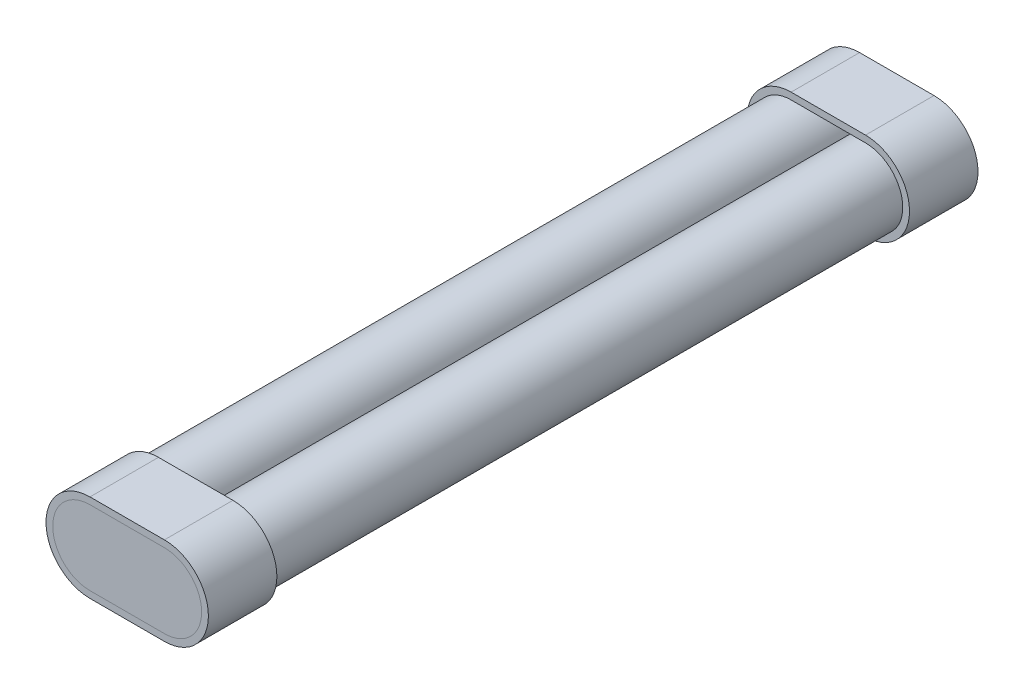
ISO-10303-21;
HEADER;
FILE_DESCRIPTION(('STEP AP214'),'2;1');
FILE_NAME('part.step','',(''),(''),'','','');
FILE_SCHEMA(('AUTOMOTIVE_DESIGN { 1 0 10303 214 1 1 1 1 }'));
ENDSEC;
DATA;
#1=APPLICATION_CONTEXT('core data for automotive mechanical design processes');
#2=APPLICATION_PROTOCOL_DEFINITION('international standard','automotive_design',2000,#1);
#3=PRODUCT_CONTEXT('',#1,'mechanical');
#4=PRODUCT('Part','Part','',(#3));
#5=PRODUCT_RELATED_PRODUCT_CATEGORY('part','',(#4));
#6=PRODUCT_DEFINITION_FORMATION('','',#4);
#7=PRODUCT_DEFINITION_CONTEXT('part definition',#1,'design');
#8=PRODUCT_DEFINITION('design','',#6,#7);
#9=PRODUCT_DEFINITION_SHAPE('','',#8);
#10=(LENGTH_UNIT() NAMED_UNIT(*) SI_UNIT(.MILLI.,.METRE.));
#11=(NAMED_UNIT(*) PLANE_ANGLE_UNIT() SI_UNIT($,.RADIAN.));
#12=(NAMED_UNIT(*) SI_UNIT($,.STERADIAN.) SOLID_ANGLE_UNIT());
#13=UNCERTAINTY_MEASURE_WITH_UNIT(LENGTH_MEASURE(1.E-05),#10,'distance_accuracy_value','');
#14=(GEOMETRIC_REPRESENTATION_CONTEXT(3) GLOBAL_UNCERTAINTY_ASSIGNED_CONTEXT((#13)) GLOBAL_UNIT_ASSIGNED_CONTEXT((#10,
#11,#12)) REPRESENTATION_CONTEXT('',''));
#15=CARTESIAN_POINT('',(0.,0.,0.));
#16=DIRECTION('',(0.,0.,1.));
#17=DIRECTION('',(1.,0.,0.));
#18=AXIS2_PLACEMENT_3D('',#15,#16,#17);
#19=CARTESIAN_POINT('',(0.,-11.,-225.5));
#20=DIRECTION('',(0.,1.,0.));
#21=DIRECTION('',(-1.,0.,0.));
#22=AXIS2_PLACEMENT_3D('',#19,#20,#21);
#23=PLANE('',#22);
#24=DIRECTION('',(-1.,0.,0.));
#25=VECTOR('',#24,1.);
#26=CARTESIAN_POINT('',(0.,-11.,-223.5));
#27=LINE('',#26,#25);
#28=CARTESIAN_POINT('',(11.,-11.,-223.5));
#29=VERTEX_POINT('',#28);
#30=CARTESIAN_POINT('',(-11.,-11.,-223.5));
#31=VERTEX_POINT('',#30);
#32=EDGE_CURVE('E118',#29,#31,#27,.T.);
#33=ORIENTED_EDGE('',*,*,#32,.T.);
#34=DIRECTION('',(0.,0.,1.));
#35=VECTOR('',#34,1.);
#36=CARTESIAN_POINT('',(-11.,-11.,-225.5));
#37=LINE('',#36,#35);
#38=CARTESIAN_POINT('',(-11.,-11.,-225.5));
#39=VERTEX_POINT('',#38);
#40=EDGE_CURVE('E13',#39,#31,#37,.T.);
#41=ORIENTED_EDGE('',*,*,#40,.F.);
#42=DIRECTION('',(-1.,0.,0.));
#43=VECTOR('',#42,1.);
#44=CARTESIAN_POINT('',(0.,-11.,-225.5));
#45=LINE('',#44,#43);
#46=CARTESIAN_POINT('',(11.,-11.,-225.5));
#47=VERTEX_POINT('',#46);
#48=EDGE_CURVE('E103',#47,#39,#45,.T.);
#49=ORIENTED_EDGE('',*,*,#48,.F.);
#50=DIRECTION('',(0.,0.,1.));
#51=VECTOR('',#50,1.);
#52=CARTESIAN_POINT('',(11.,-11.,-225.5));
#53=LINE('',#52,#51);
#54=EDGE_CURVE('E114',#47,#29,#53,.T.);
#55=ORIENTED_EDGE('',*,*,#54,.T.);
#56=EDGE_LOOP('',(#33,#41,#49,#55));
#57=FACE_BOUND('',#56,.T.);
#58=ADVANCED_FACE('F56',(#57),#23,.F.);
#59=CARTESIAN_POINT('',(-11.,0.,-225.5));
#60=DIRECTION('',(0.,0.,1.));
#61=DIRECTION('',(1.,0.,0.));
#62=AXIS2_PLACEMENT_3D('',#59,#60,#61);
#63=CYLINDRICAL_SURFACE('',#62,11.);
#64=CARTESIAN_POINT('',(-11.,0.,-223.5));
#65=DIRECTION('',(0.,0.,-1.));
#66=DIRECTION('',(-1.,0.,0.));
#67=AXIS2_PLACEMENT_3D('',#64,#65,#66);
#68=CIRCLE('',#67,11.);
#69=CARTESIAN_POINT('',(-11.,11.,-223.5));
#70=VERTEX_POINT('',#69);
#71=EDGE_CURVE('E108',#31,#70,#68,.T.);
#72=ORIENTED_EDGE('',*,*,#71,.T.);
#73=DIRECTION('',(0.,0.,1.));
#74=VECTOR('',#73,1.);
#75=CARTESIAN_POINT('',(-11.,11.,-225.5));
#76=LINE('',#75,#74);
#77=CARTESIAN_POINT('',(-11.,11.,-225.5));
#78=VERTEX_POINT('',#77);
#79=EDGE_CURVE('E64',#78,#70,#76,.T.);
#80=ORIENTED_EDGE('',*,*,#79,.F.);
#81=CARTESIAN_POINT('',(-11.,0.,-225.5));
#82=DIRECTION('',(0.,0.,-1.));
#83=DIRECTION('',(-1.,0.,0.));
#84=AXIS2_PLACEMENT_3D('',#81,#82,#83);
#85=CIRCLE('',#84,11.);
#86=EDGE_CURVE('E98',#39,#78,#85,.T.);
#87=ORIENTED_EDGE('',*,*,#86,.F.);
#88=ORIENTED_EDGE('',*,*,#40,.T.);
#89=EDGE_LOOP('',(#72,#80,#87,#88));
#90=FACE_BOUND('',#89,.T.);
#91=ADVANCED_FACE('F107',(#90),#63,.T.);
#92=CARTESIAN_POINT('',(0.,11.,-225.5));
#93=DIRECTION('',(0.,1.,0.));
#94=DIRECTION('',(-1.,0.,0.));
#95=AXIS2_PLACEMENT_3D('',#92,#93,#94);
#96=PLANE('',#95);
#97=DIRECTION('',(-1.,0.,0.));
#98=VECTOR('',#97,1.);
#99=CARTESIAN_POINT('',(0.,11.,-223.5));
#100=LINE('',#99,#98);
#101=CARTESIAN_POINT('',(11.,11.,-223.5));
#102=VERTEX_POINT('',#101);
#103=EDGE_CURVE('E122',#102,#70,#100,.T.);
#104=ORIENTED_EDGE('',*,*,#103,.F.);
#105=DIRECTION('',(0.,0.,1.));
#106=VECTOR('',#105,1.);
#107=CARTESIAN_POINT('',(11.,11.,-225.5));
#108=LINE('',#107,#106);
#109=CARTESIAN_POINT('',(11.,11.,-225.5));
#110=VERTEX_POINT('',#109);
#111=EDGE_CURVE('E88',#110,#102,#108,.T.);
#112=ORIENTED_EDGE('',*,*,#111,.F.);
#113=DIRECTION('',(-1.,0.,0.));
#114=VECTOR('',#113,1.);
#115=CARTESIAN_POINT('',(0.,11.,-225.5));
#116=LINE('',#115,#114);
#117=EDGE_CURVE('E101',#110,#78,#116,.T.);
#118=ORIENTED_EDGE('',*,*,#117,.T.);
#119=ORIENTED_EDGE('',*,*,#79,.T.);
#120=EDGE_LOOP('',(#104,#112,#118,#119));
#121=FACE_BOUND('',#120,.T.);
#122=ADVANCED_FACE('F112',(#121),#96,.T.);
#123=CARTESIAN_POINT('',(11.,0.,-225.5));
#124=DIRECTION('',(0.,0.,1.));
#125=DIRECTION('',(1.,0.,0.));
#126=AXIS2_PLACEMENT_3D('',#123,#124,#125);
#127=CYLINDRICAL_SURFACE('',#126,11.);
#128=CARTESIAN_POINT('',(11.,0.,-223.5));
#129=DIRECTION('',(0.,0.,-1.));
#130=DIRECTION('',(-1.,0.,0.));
#131=AXIS2_PLACEMENT_3D('',#128,#129,#130);
#132=CIRCLE('',#131,11.);
#133=EDGE_CURVE('E91',#102,#29,#132,.T.);
#134=ORIENTED_EDGE('',*,*,#133,.T.);
#135=ORIENTED_EDGE('',*,*,#54,.F.);
#136=CARTESIAN_POINT('',(11.,0.,-225.5));
#137=DIRECTION('',(0.,0.,-1.));
#138=DIRECTION('',(-1.,0.,0.));
#139=AXIS2_PLACEMENT_3D('',#136,#137,#138);
#140=CIRCLE('',#139,11.);
#141=EDGE_CURVE('E72',#110,#47,#140,.T.);
#142=ORIENTED_EDGE('',*,*,#141,.F.);
#143=ORIENTED_EDGE('',*,*,#111,.T.);
#144=EDGE_LOOP('',(#134,#135,#142,#143));
#145=FACE_BOUND('',#144,.T.);
#146=ADVANCED_FACE('F135',(#145),#127,.T.);
#147=CARTESIAN_POINT('',(0.,0.,-225.5));
#148=DIRECTION('',(0.,0.,-1.));
#149=DIRECTION('',(-1.,0.,0.));
#150=AXIS2_PLACEMENT_3D('',#147,#148,#149);
#151=PLANE('',#150);
#152=ORIENTED_EDGE('',*,*,#48,.T.);
#153=ORIENTED_EDGE('',*,*,#86,.T.);
#154=ORIENTED_EDGE('',*,*,#117,.F.);
#155=ORIENTED_EDGE('',*,*,#141,.T.);
#156=EDGE_LOOP('',(#152,#153,#154,#155));
#157=FACE_BOUND('',#156,.T.);
#158=ADVANCED_FACE('F99',(#157),#151,.T.);
#159=CARTESIAN_POINT('',(0.,0.,-223.5));
#160=DIRECTION('',(0.,0.,-1.));
#161=DIRECTION('',(-1.,0.,0.));
#162=AXIS2_PLACEMENT_3D('',#159,#160,#161);
#163=PLANE('',#162);
#164=ORIENTED_EDGE('',*,*,#32,.F.);
#165=ORIENTED_EDGE('',*,*,#133,.F.);
#166=ORIENTED_EDGE('',*,*,#103,.T.);
#167=ORIENTED_EDGE('',*,*,#71,.F.);
#168=EDGE_LOOP('',(#164,#165,#166,#167));
#169=FACE_BOUND('',#168,.T.);
#170=ADVANCED_FACE('F129',(#169),#163,.F.);
#171=CLOSED_SHELL('',(#58,#91,#122,#146,#158,#170));
#172=MANIFOLD_SOLID_BREP('B2',#171);
#173=CARTESIAN_POINT('',(0.,-13.,-225.5));
#174=DIRECTION('',(0.,1.,0.));
#175=DIRECTION('',(0.,0.,1.));
#176=AXIS2_PLACEMENT_3D('',#173,#174,#175);
#177=PLANE('',#176);
#178=DIRECTION('',(0.,0.,1.));
#179=VECTOR('',#178,1.);
#180=CARTESIAN_POINT('',(11.,-13.,-225.5));
#181=LINE('',#180,#179);
#182=CARTESIAN_POINT('',(11.,-13.,-225.5));
#183=VERTEX_POINT('',#182);
#184=CARTESIAN_POINT('',(11.,-13.,-205.25));
#185=VERTEX_POINT('',#184);
#186=EDGE_CURVE('E300',#183,#185,#181,.T.);
#187=ORIENTED_EDGE('',*,*,#186,.T.);
#188=DIRECTION('',(-1.,0.,0.));
#189=VECTOR('',#188,1.);
#190=CARTESIAN_POINT('',(0.,-13.,-205.25));
#191=LINE('',#190,#189);
#192=CARTESIAN_POINT('',(-11.,-13.,-205.25));
#193=VERTEX_POINT('',#192);
#194=EDGE_CURVE('E319',#185,#193,#191,.T.);
#195=ORIENTED_EDGE('',*,*,#194,.T.);
#196=DIRECTION('',(0.,0.,1.));
#197=VECTOR('',#196,1.);
#198=CARTESIAN_POINT('',(-11.,-13.,-225.5));
#199=LINE('',#198,#197);
#200=CARTESIAN_POINT('',(-11.,-13.,-225.5));
#201=VERTEX_POINT('',#200);
#202=EDGE_CURVE('E54',#201,#193,#199,.T.);
#203=ORIENTED_EDGE('',*,*,#202,.F.);
#204=DIRECTION('',(-1.,0.,0.));
#205=VECTOR('',#204,1.);
#206=CARTESIAN_POINT('',(0.,-13.,-225.5));
#207=LINE('',#206,#205);
#208=EDGE_CURVE('E340',#183,#201,#207,.T.);
#209=ORIENTED_EDGE('',*,*,#208,.F.);
#210=EDGE_LOOP('',(#187,#195,#203,#209));
#211=FACE_BOUND('',#210,.T.);
#212=ADVANCED_FACE('F223',(#211),#177,.F.);
#213=CARTESIAN_POINT('',(-11.,0.,-225.5));
#214=DIRECTION('',(0.,0.,1.));
#215=DIRECTION('',(1.,0.,0.));
#216=AXIS2_PLACEMENT_3D('',#213,#214,#215);
#217=CYLINDRICAL_SURFACE('',#216,13.);
#218=ORIENTED_EDGE('',*,*,#202,.T.);
#219=CARTESIAN_POINT('',(-11.,0.,-205.25));
#220=DIRECTION('',(0.,0.,-1.));
#221=DIRECTION('',(-1.,0.,0.));
#222=AXIS2_PLACEMENT_3D('',#219,#220,#221);
#223=CIRCLE('',#222,13.);
#224=CARTESIAN_POINT('',(-11.,13.,-205.25));
#225=VERTEX_POINT('',#224);
#226=EDGE_CURVE('E322',#193,#225,#223,.T.);
#227=ORIENTED_EDGE('',*,*,#226,.T.);
#228=DIRECTION('',(0.,0.,1.));
#229=VECTOR('',#228,1.);
#230=CARTESIAN_POINT('',(-11.,13.,-225.5));
#231=LINE('',#230,#229);
#232=CARTESIAN_POINT('',(-11.,13.,-225.5));
#233=VERTEX_POINT('',#232);
#234=EDGE_CURVE('E232',#233,#225,#231,.T.);
#235=ORIENTED_EDGE('',*,*,#234,.F.);
#236=CARTESIAN_POINT('',(-11.,0.,-225.5));
#237=DIRECTION('',(0.,0.,-1.));
#238=DIRECTION('',(-1.,0.,0.));
#239=AXIS2_PLACEMENT_3D('',#236,#237,#238);
#240=CIRCLE('',#239,13.);
#241=EDGE_CURVE('E342',#201,#233,#240,.T.);
#242=ORIENTED_EDGE('',*,*,#241,.F.);
#243=EDGE_LOOP('',(#218,#227,#235,#242));
#244=FACE_BOUND('',#243,.T.);
#245=ADVANCED_FACE('F372',(#244),#217,.T.);
#246=CARTESIAN_POINT('',(0.,13.,-225.5));
#247=DIRECTION('',(0.,1.,0.));
#248=DIRECTION('',(0.,0.,1.));
#249=AXIS2_PLACEMENT_3D('',#246,#247,#248);
#250=PLANE('',#249);
#251=ORIENTED_EDGE('',*,*,#234,.T.);
#252=DIRECTION('',(-1.,0.,0.));
#253=VECTOR('',#252,1.);
#254=CARTESIAN_POINT('',(0.,13.,-205.25));
#255=LINE('',#254,#253);
#256=CARTESIAN_POINT('',(11.,13.,-205.25));
#257=VERTEX_POINT('',#256);
#258=EDGE_CURVE('E325',#257,#225,#255,.T.);
#259=ORIENTED_EDGE('',*,*,#258,.F.);
#260=DIRECTION('',(0.,0.,1.));
#261=VECTOR('',#260,1.);
#262=CARTESIAN_POINT('',(11.,13.,-225.5));
#263=LINE('',#262,#261);
#264=CARTESIAN_POINT('',(11.,13.,-225.5));
#265=VERTEX_POINT('',#264);
#266=EDGE_CURVE('E248',#265,#257,#263,.T.);
#267=ORIENTED_EDGE('',*,*,#266,.F.);
#268=DIRECTION('',(-1.,0.,0.));
#269=VECTOR('',#268,1.);
#270=CARTESIAN_POINT('',(0.,13.,-225.5));
#271=LINE('',#270,#269);
#272=EDGE_CURVE('E344',#265,#233,#271,.T.);
#273=ORIENTED_EDGE('',*,*,#272,.T.);
#274=EDGE_LOOP('',(#251,#259,#267,#273));
#275=FACE_BOUND('',#274,.T.);
#276=ADVANCED_FACE('F377',(#275),#250,.T.);
#277=CARTESIAN_POINT('',(11.,0.,-225.5));
#278=DIRECTION('',(0.,0.,1.));
#279=DIRECTION('',(1.,0.,0.));
#280=AXIS2_PLACEMENT_3D('',#277,#278,#279);
#281=CYLINDRICAL_SURFACE('',#280,11.);
#282=DIRECTION('',(0.,0.,1.));
#283=VECTOR('',#282,1.);
#284=CARTESIAN_POINT('',(11.,-11.,-225.5));
#285=LINE('',#284,#283);
#286=CARTESIAN_POINT('',(11.,-11.,-225.5));
#287=VERTEX_POINT('',#286);
#288=CARTESIAN_POINT('',(11.,-11.,-205.25));
#289=VERTEX_POINT('',#288);
#290=EDGE_CURVE('E304',#287,#289,#285,.T.);
#291=ORIENTED_EDGE('',*,*,#290,.T.);
#292=CARTESIAN_POINT('',(11.,0.,-205.25));
#293=DIRECTION('',(0.,0.,-1.));
#294=DIRECTION('',(-1.,0.,0.));
#295=AXIS2_PLACEMENT_3D('',#292,#293,#294);
#296=CIRCLE('',#295,11.);
#297=CARTESIAN_POINT('',(11.,11.,-205.25));
#298=VERTEX_POINT('',#297);
#299=EDGE_CURVE('E303',#298,#289,#296,.T.);
#300=ORIENTED_EDGE('',*,*,#299,.F.);
#301=DIRECTION('',(0.,0.,1.));
#302=VECTOR('',#301,1.);
#303=CARTESIAN_POINT('',(11.,11.,-225.5));
#304=LINE('',#303,#302);
#305=CARTESIAN_POINT('',(11.,11.,-225.5));
#306=VERTEX_POINT('',#305);
#307=EDGE_CURVE('E227',#306,#298,#304,.T.);
#308=ORIENTED_EDGE('',*,*,#307,.F.);
#309=CARTESIAN_POINT('',(11.,0.,-225.5));
#310=DIRECTION('',(0.,0.,-1.));
#311=DIRECTION('',(-1.,0.,0.));
#312=AXIS2_PLACEMENT_3D('',#309,#310,#311);
#313=CIRCLE('',#312,11.);
#314=EDGE_CURVE('E331',#306,#287,#313,.T.);
#315=ORIENTED_EDGE('',*,*,#314,.T.);
#316=EDGE_LOOP('',(#291,#300,#308,#315));
#317=FACE_BOUND('',#316,.T.);
#318=ADVANCED_FACE('F225',(#317),#281,.F.);
#319=CARTESIAN_POINT('',(0.,11.,-225.5));
#320=DIRECTION('',(0.,1.,0.));
#321=DIRECTION('',(-1.,0.,0.));
#322=AXIS2_PLACEMENT_3D('',#319,#320,#321);
#323=PLANE('',#322);
#324=ORIENTED_EDGE('',*,*,#307,.T.);
#325=DIRECTION('',(-1.,0.,0.));
#326=VECTOR('',#325,1.);
#327=CARTESIAN_POINT('',(0.,11.,-205.25));
#328=LINE('',#327,#326);
#329=CARTESIAN_POINT('',(-11.,11.,-205.25));
#330=VERTEX_POINT('',#329);
#331=EDGE_CURVE('E295',#298,#330,#328,.T.);
#332=ORIENTED_EDGE('',*,*,#331,.T.);
#333=DIRECTION('',(0.,0.,1.));
#334=VECTOR('',#333,1.);
#335=CARTESIAN_POINT('',(-11.,11.,-225.5));
#336=LINE('',#335,#334);
#337=CARTESIAN_POINT('',(-11.,11.,-225.5));
#338=VERTEX_POINT('',#337);
#339=EDGE_CURVE('E301',#338,#330,#336,.T.);
#340=ORIENTED_EDGE('',*,*,#339,.F.);
#341=DIRECTION('',(-1.,0.,0.));
#342=VECTOR('',#341,1.);
#343=CARTESIAN_POINT('',(0.,11.,-225.5));
#344=LINE('',#343,#342);
#345=EDGE_CURVE('E296',#306,#338,#344,.T.);
#346=ORIENTED_EDGE('',*,*,#345,.F.);
#347=EDGE_LOOP('',(#324,#332,#340,#346));
#348=FACE_BOUND('',#347,.T.);
#349=ADVANCED_FACE('F292',(#348),#323,.F.);
#350=CARTESIAN_POINT('',(-11.,0.,-225.5));
#351=DIRECTION('',(0.,0.,1.));
#352=DIRECTION('',(1.,0.,0.));
#353=AXIS2_PLACEMENT_3D('',#350,#351,#352);
#354=CYLINDRICAL_SURFACE('',#353,11.);
#355=ORIENTED_EDGE('',*,*,#339,.T.);
#356=CARTESIAN_POINT('',(-11.,0.,-205.25));
#357=DIRECTION('',(0.,0.,-1.));
#358=DIRECTION('',(-1.,0.,0.));
#359=AXIS2_PLACEMENT_3D('',#356,#357,#358);
#360=CIRCLE('',#359,11.);
#361=CARTESIAN_POINT('',(-11.,-11.,-205.25));
#362=VERTEX_POINT('',#361);
#363=EDGE_CURVE('E313',#362,#330,#360,.T.);
#364=ORIENTED_EDGE('',*,*,#363,.F.);
#365=DIRECTION('',(0.,0.,1.));
#366=VECTOR('',#365,1.);
#367=CARTESIAN_POINT('',(-11.,-11.,-225.5));
#368=LINE('',#367,#366);
#369=CARTESIAN_POINT('',(-11.,-11.,-225.5));
#370=VERTEX_POINT('',#369);
#371=EDGE_CURVE('E351',#370,#362,#368,.T.);
#372=ORIENTED_EDGE('',*,*,#371,.F.);
#373=CARTESIAN_POINT('',(-11.,0.,-225.5));
#374=DIRECTION('',(0.,0.,-1.));
#375=DIRECTION('',(-1.,0.,0.));
#376=AXIS2_PLACEMENT_3D('',#373,#374,#375);
#377=CIRCLE('',#376,11.);
#378=EDGE_CURVE('E334',#370,#338,#377,.T.);
#379=ORIENTED_EDGE('',*,*,#378,.T.);
#380=EDGE_LOOP('',(#355,#364,#372,#379));
#381=FACE_BOUND('',#380,.T.);
#382=ADVANCED_FACE('F353',(#381),#354,.F.);
#383=CARTESIAN_POINT('',(0.,-11.,-225.5));
#384=DIRECTION('',(0.,1.,0.));
#385=DIRECTION('',(-1.,0.,0.));
#386=AXIS2_PLACEMENT_3D('',#383,#384,#385);
#387=PLANE('',#386);
#388=ORIENTED_EDGE('',*,*,#371,.T.);
#389=DIRECTION('',(-1.,0.,0.));
#390=VECTOR('',#389,1.);
#391=CARTESIAN_POINT('',(0.,-11.,-205.25));
#392=LINE('',#391,#390);
#393=EDGE_CURVE('E315',#289,#362,#392,.T.);
#394=ORIENTED_EDGE('',*,*,#393,.F.);
#395=ORIENTED_EDGE('',*,*,#290,.F.);
#396=DIRECTION('',(-1.,0.,0.));
#397=VECTOR('',#396,1.);
#398=CARTESIAN_POINT('',(0.,-11.,-225.5));
#399=LINE('',#398,#397);
#400=EDGE_CURVE('E337',#287,#370,#399,.T.);
#401=ORIENTED_EDGE('',*,*,#400,.T.);
#402=EDGE_LOOP('',(#388,#394,#395,#401));
#403=FACE_BOUND('',#402,.T.);
#404=ADVANCED_FACE('F359',(#403),#387,.T.);
#405=CARTESIAN_POINT('',(11.,0.,-225.5));
#406=DIRECTION('',(0.,0.,1.));
#407=DIRECTION('',(1.,0.,0.));
#408=AXIS2_PLACEMENT_3D('',#405,#406,#407);
#409=CYLINDRICAL_SURFACE('',#408,13.);
#410=ORIENTED_EDGE('',*,*,#266,.T.);
#411=CARTESIAN_POINT('',(11.,0.,-205.25));
#412=DIRECTION('',(0.,0.,-1.));
#413=DIRECTION('',(-1.,0.,0.));
#414=AXIS2_PLACEMENT_3D('',#411,#412,#413);
#415=CIRCLE('',#414,13.);
#416=EDGE_CURVE('E328',#257,#185,#415,.T.);
#417=ORIENTED_EDGE('',*,*,#416,.T.);
#418=ORIENTED_EDGE('',*,*,#186,.F.);
#419=CARTESIAN_POINT('',(11.,0.,-225.5));
#420=DIRECTION('',(0.,0.,-1.));
#421=DIRECTION('',(-1.,0.,0.));
#422=AXIS2_PLACEMENT_3D('',#419,#420,#421);
#423=CIRCLE('',#422,13.);
#424=EDGE_CURVE('E240',#265,#183,#423,.T.);
#425=ORIENTED_EDGE('',*,*,#424,.F.);
#426=EDGE_LOOP('',(#410,#417,#418,#425));
#427=FACE_BOUND('',#426,.T.);
#428=ADVANCED_FACE('F361',(#427),#409,.T.);
#429=CARTESIAN_POINT('',(0.,0.,-225.5));
#430=DIRECTION('',(0.,0.,-1.));
#431=DIRECTION('',(-1.,0.,0.));
#432=AXIS2_PLACEMENT_3D('',#429,#430,#431);
#433=PLANE('',#432);
#434=ORIENTED_EDGE('',*,*,#314,.F.);
#435=ORIENTED_EDGE('',*,*,#345,.T.);
#436=ORIENTED_EDGE('',*,*,#378,.F.);
#437=ORIENTED_EDGE('',*,*,#400,.F.);
#438=EDGE_LOOP('',(#434,#435,#436,#437));
#439=FACE_BOUND('',#438,.T.);
#440=ORIENTED_EDGE('',*,*,#208,.T.);
#441=ORIENTED_EDGE('',*,*,#241,.T.);
#442=ORIENTED_EDGE('',*,*,#272,.F.);
#443=ORIENTED_EDGE('',*,*,#424,.T.);
#444=EDGE_LOOP('',(#440,#441,#442,#443));
#445=FACE_BOUND('',#444,.T.);
#446=ADVANCED_FACE('F357',(#439,#445),#433,.T.);
#447=CARTESIAN_POINT('',(0.,0.,-205.25));
#448=DIRECTION('',(0.,0.,-1.));
#449=DIRECTION('',(-1.,0.,0.));
#450=AXIS2_PLACEMENT_3D('',#447,#448,#449);
#451=PLANE('',#450);
#452=ORIENTED_EDGE('',*,*,#299,.T.);
#453=ORIENTED_EDGE('',*,*,#393,.T.);
#454=ORIENTED_EDGE('',*,*,#363,.T.);
#455=ORIENTED_EDGE('',*,*,#331,.F.);
#456=EDGE_LOOP('',(#452,#453,#454,#455));
#457=FACE_BOUND('',#456,.T.);
#458=ORIENTED_EDGE('',*,*,#194,.F.);
#459=ORIENTED_EDGE('',*,*,#416,.F.);
#460=ORIENTED_EDGE('',*,*,#258,.T.);
#461=ORIENTED_EDGE('',*,*,#226,.F.);
#462=EDGE_LOOP('',(#458,#459,#460,#461));
#463=FACE_BOUND('',#462,.T.);
#464=ADVANCED_FACE('F310',(#457,#463),#451,.F.);
#465=CLOSED_SHELL('',(#212,#245,#276,#318,#349,#382,#404,#428,#446,#464));
#466=MANIFOLD_SOLID_BREP('B7',#465);
#467=CARTESIAN_POINT('',(0.,-11.,2.));
#468=DIRECTION('',(0.,1.,0.));
#469=DIRECTION('',(0.,0.,1.));
#470=AXIS2_PLACEMENT_3D('',#467,#468,#469);
#471=PLANE('',#470);
#472=DIRECTION('',(1.,0.,0.));
#473=VECTOR('',#472,1.);
#474=CARTESIAN_POINT('',(0.,-11.,0.));
#475=LINE('',#474,#473);
#476=CARTESIAN_POINT('',(-11.,-11.,0.));
#477=VERTEX_POINT('',#476);
#478=CARTESIAN_POINT('',(11.,-11.,0.));
#479=VERTEX_POINT('',#478);
#480=EDGE_CURVE('E548',#477,#479,#475,.T.);
#481=ORIENTED_EDGE('',*,*,#480,.T.);
#482=DIRECTION('',(0.,0.,-1.));
#483=VECTOR('',#482,1.);
#484=CARTESIAN_POINT('',(11.,-11.,2.));
#485=LINE('',#484,#483);
#486=CARTESIAN_POINT('',(11.,-11.,2.));
#487=VERTEX_POINT('',#486);
#488=EDGE_CURVE('E221',#487,#479,#485,.T.);
#489=ORIENTED_EDGE('',*,*,#488,.F.);
#490=DIRECTION('',(1.,0.,0.));
#491=VECTOR('',#490,1.);
#492=CARTESIAN_POINT('',(0.,-11.,2.));
#493=LINE('',#492,#491);
#494=CARTESIAN_POINT('',(-11.,-11.,2.));
#495=VERTEX_POINT('',#494);
#496=EDGE_CURVE('E533',#495,#487,#493,.T.);
#497=ORIENTED_EDGE('',*,*,#496,.F.);
#498=DIRECTION('',(0.,0.,-1.));
#499=VECTOR('',#498,1.);
#500=CARTESIAN_POINT('',(-11.,-11.,2.));
#501=LINE('',#500,#499);
#502=EDGE_CURVE('E544',#495,#477,#501,.T.);
#503=ORIENTED_EDGE('',*,*,#502,.T.);
#504=EDGE_LOOP('',(#481,#489,#497,#503));
#505=FACE_BOUND('',#504,.T.);
#506=ADVANCED_FACE('F486',(#505),#471,.F.);
#507=CARTESIAN_POINT('',(11.,0.,2.));
#508=DIRECTION('',(0.,0.,-1.));
#509=DIRECTION('',(-1.,0.,0.));
#510=AXIS2_PLACEMENT_3D('',#507,#508,#509);
#511=CYLINDRICAL_SURFACE('',#510,11.);
#512=CARTESIAN_POINT('',(11.,0.,0.));
#513=DIRECTION('',(0.,0.,1.));
#514=DIRECTION('',(1.,0.,0.));
#515=AXIS2_PLACEMENT_3D('',#512,#513,#514);
#516=CIRCLE('',#515,11.);
#517=CARTESIAN_POINT('',(11.,11.,0.));
#518=VERTEX_POINT('',#517);
#519=EDGE_CURVE('E538',#479,#518,#516,.T.);
#520=ORIENTED_EDGE('',*,*,#519,.T.);
#521=DIRECTION('',(0.,0.,-1.));
#522=VECTOR('',#521,1.);
#523=CARTESIAN_POINT('',(11.,11.,2.));
#524=LINE('',#523,#522);
#525=CARTESIAN_POINT('',(11.,11.,2.));
#526=VERTEX_POINT('',#525);
#527=EDGE_CURVE('E494',#526,#518,#524,.T.);
#528=ORIENTED_EDGE('',*,*,#527,.F.);
#529=CARTESIAN_POINT('',(11.,0.,2.));
#530=DIRECTION('',(0.,0.,1.));
#531=DIRECTION('',(1.,0.,0.));
#532=AXIS2_PLACEMENT_3D('',#529,#530,#531);
#533=CIRCLE('',#532,11.);
#534=EDGE_CURVE('E528',#487,#526,#533,.T.);
#535=ORIENTED_EDGE('',*,*,#534,.F.);
#536=ORIENTED_EDGE('',*,*,#488,.T.);
#537=EDGE_LOOP('',(#520,#528,#535,#536));
#538=FACE_BOUND('',#537,.T.);
#539=ADVANCED_FACE('F537',(#538),#511,.T.);
#540=CARTESIAN_POINT('',(0.,11.,2.));
#541=DIRECTION('',(0.,1.,0.));
#542=DIRECTION('',(0.,0.,1.));
#543=AXIS2_PLACEMENT_3D('',#540,#541,#542);
#544=PLANE('',#543);
#545=DIRECTION('',(1.,0.,0.));
#546=VECTOR('',#545,1.);
#547=CARTESIAN_POINT('',(0.,11.,0.));
#548=LINE('',#547,#546);
#549=CARTESIAN_POINT('',(-11.,11.,0.));
#550=VERTEX_POINT('',#549);
#551=EDGE_CURVE('E552',#550,#518,#548,.T.);
#552=ORIENTED_EDGE('',*,*,#551,.F.);
#553=DIRECTION('',(0.,0.,-1.));
#554=VECTOR('',#553,1.);
#555=CARTESIAN_POINT('',(-11.,11.,2.));
#556=LINE('',#555,#554);
#557=CARTESIAN_POINT('',(-11.,11.,2.));
#558=VERTEX_POINT('',#557);
#559=EDGE_CURVE('E518',#558,#550,#556,.T.);
#560=ORIENTED_EDGE('',*,*,#559,.F.);
#561=DIRECTION('',(1.,0.,0.));
#562=VECTOR('',#561,1.);
#563=CARTESIAN_POINT('',(0.,11.,2.));
#564=LINE('',#563,#562);
#565=EDGE_CURVE('E531',#558,#526,#564,.T.);
#566=ORIENTED_EDGE('',*,*,#565,.T.);
#567=ORIENTED_EDGE('',*,*,#527,.T.);
#568=EDGE_LOOP('',(#552,#560,#566,#567));
#569=FACE_BOUND('',#568,.T.);
#570=ADVANCED_FACE('F542',(#569),#544,.T.);
#571=CARTESIAN_POINT('',(-11.,0.,2.));
#572=DIRECTION('',(0.,0.,-1.));
#573=DIRECTION('',(-1.,0.,0.));
#574=AXIS2_PLACEMENT_3D('',#571,#572,#573);
#575=CYLINDRICAL_SURFACE('',#574,11.);
#576=CARTESIAN_POINT('',(-11.,0.,0.));
#577=DIRECTION('',(0.,0.,1.));
#578=DIRECTION('',(1.,0.,0.));
#579=AXIS2_PLACEMENT_3D('',#576,#577,#578);
#580=CIRCLE('',#579,11.);
#581=EDGE_CURVE('E521',#550,#477,#580,.T.);
#582=ORIENTED_EDGE('',*,*,#581,.T.);
#583=ORIENTED_EDGE('',*,*,#502,.F.);
#584=CARTESIAN_POINT('',(-11.,0.,2.));
#585=DIRECTION('',(0.,0.,1.));
#586=DIRECTION('',(1.,0.,0.));
#587=AXIS2_PLACEMENT_3D('',#584,#585,#586);
#588=CIRCLE('',#587,11.);
#589=EDGE_CURVE('E502',#558,#495,#588,.T.);
#590=ORIENTED_EDGE('',*,*,#589,.F.);
#591=ORIENTED_EDGE('',*,*,#559,.T.);
#592=EDGE_LOOP('',(#582,#583,#590,#591));
#593=FACE_BOUND('',#592,.T.);
#594=ADVANCED_FACE('F565',(#593),#575,.T.);
#595=CARTESIAN_POINT('',(0.,0.,2.));
#596=DIRECTION('',(0.,0.,1.));
#597=DIRECTION('',(1.,0.,0.));
#598=AXIS2_PLACEMENT_3D('',#595,#596,#597);
#599=PLANE('',#598);
#600=ORIENTED_EDGE('',*,*,#496,.T.);
#601=ORIENTED_EDGE('',*,*,#534,.T.);
#602=ORIENTED_EDGE('',*,*,#565,.F.);
#603=ORIENTED_EDGE('',*,*,#589,.T.);
#604=EDGE_LOOP('',(#600,#601,#602,#603));
#605=FACE_BOUND('',#604,.T.);
#606=ADVANCED_FACE('F529',(#605),#599,.T.);
#607=CARTESIAN_POINT('',(0.,0.,0.));
#608=DIRECTION('',(0.,0.,1.));
#609=DIRECTION('',(1.,0.,0.));
#610=AXIS2_PLACEMENT_3D('',#607,#608,#609);
#611=PLANE('',#610);
#612=ORIENTED_EDGE('',*,*,#480,.F.);
#613=ORIENTED_EDGE('',*,*,#581,.F.);
#614=ORIENTED_EDGE('',*,*,#551,.T.);
#615=ORIENTED_EDGE('',*,*,#519,.F.);
#616=EDGE_LOOP('',(#612,#613,#614,#615));
#617=FACE_BOUND('',#616,.T.);
#618=ADVANCED_FACE('F559',(#617),#611,.F.);
#619=CLOSED_SHELL('',(#506,#539,#570,#594,#606,#618));
#620=MANIFOLD_SOLID_BREP('B48',#619);
#621=CARTESIAN_POINT('',(0.,-13.,2.));
#622=DIRECTION('',(0.,1.,0.));
#623=DIRECTION('',(0.,0.,1.));
#624=AXIS2_PLACEMENT_3D('',#621,#622,#623);
#625=PLANE('',#624);
#626=DIRECTION('',(0.,0.,-1.));
#627=VECTOR('',#626,1.);
#628=CARTESIAN_POINT('',(-11.,-13.,2.));
#629=LINE('',#628,#627);
#630=CARTESIAN_POINT('',(-11.,-13.,2.));
#631=VERTEX_POINT('',#630);
#632=CARTESIAN_POINT('',(-11.,-13.,-18.25));
#633=VERTEX_POINT('',#632);
#634=EDGE_CURVE('E725',#631,#633,#629,.T.);
#635=ORIENTED_EDGE('',*,*,#634,.T.);
#636=DIRECTION('',(1.,0.,0.));
#637=VECTOR('',#636,1.);
#638=CARTESIAN_POINT('',(0.,-13.,-18.25));
#639=LINE('',#638,#637);
#640=CARTESIAN_POINT('',(11.,-13.,-18.25));
#641=VERTEX_POINT('',#640);
#642=EDGE_CURVE('E745',#633,#641,#639,.T.);
#643=ORIENTED_EDGE('',*,*,#642,.T.);
#644=DIRECTION('',(0.,0.,-1.));
#645=VECTOR('',#644,1.);
#646=CARTESIAN_POINT('',(11.,-13.,2.));
#647=LINE('',#646,#645);
#648=CARTESIAN_POINT('',(11.,-13.,2.));
#649=VERTEX_POINT('',#648);
#650=EDGE_CURVE('E484',#649,#641,#647,.T.);
#651=ORIENTED_EDGE('',*,*,#650,.F.);
#652=DIRECTION('',(1.,0.,0.));
#653=VECTOR('',#652,1.);
#654=CARTESIAN_POINT('',(0.,-13.,2.));
#655=LINE('',#654,#653);
#656=EDGE_CURVE('E765',#631,#649,#655,.T.);
#657=ORIENTED_EDGE('',*,*,#656,.F.);
#658=EDGE_LOOP('',(#635,#643,#651,#657));
#659=FACE_BOUND('',#658,.T.);
#660=ADVANCED_FACE('F648',(#659),#625,.F.);
#661=CARTESIAN_POINT('',(11.,0.,2.));
#662=DIRECTION('',(0.,0.,-1.));
#663=DIRECTION('',(-1.,0.,0.));
#664=AXIS2_PLACEMENT_3D('',#661,#662,#663);
#665=CYLINDRICAL_SURFACE('',#664,13.);
#666=ORIENTED_EDGE('',*,*,#650,.T.);
#667=CARTESIAN_POINT('',(11.,0.,-18.25));
#668=DIRECTION('',(0.,0.,1.));
#669=DIRECTION('',(1.,0.,0.));
#670=AXIS2_PLACEMENT_3D('',#667,#668,#669);
#671=CIRCLE('',#670,13.);
#672=CARTESIAN_POINT('',(11.,13.,-18.25));
#673=VERTEX_POINT('',#672);
#674=EDGE_CURVE('E748',#641,#673,#671,.T.);
#675=ORIENTED_EDGE('',*,*,#674,.T.);
#676=DIRECTION('',(0.,0.,-1.));
#677=VECTOR('',#676,1.);
#678=CARTESIAN_POINT('',(11.,13.,2.));
#679=LINE('',#678,#677);
#680=CARTESIAN_POINT('',(11.,13.,2.));
#681=VERTEX_POINT('',#680);
#682=EDGE_CURVE('E657',#681,#673,#679,.T.);
#683=ORIENTED_EDGE('',*,*,#682,.F.);
#684=CARTESIAN_POINT('',(11.,0.,2.));
#685=DIRECTION('',(0.,0.,1.));
#686=DIRECTION('',(1.,0.,0.));
#687=AXIS2_PLACEMENT_3D('',#684,#685,#686);
#688=CIRCLE('',#687,13.);
#689=EDGE_CURVE('E767',#649,#681,#688,.T.);
#690=ORIENTED_EDGE('',*,*,#689,.F.);
#691=EDGE_LOOP('',(#666,#675,#683,#690));
#692=FACE_BOUND('',#691,.T.);
#693=ADVANCED_FACE('F797',(#692),#665,.T.);
#694=CARTESIAN_POINT('',(0.,13.,2.));
#695=DIRECTION('',(0.,1.,0.));
#696=DIRECTION('',(0.,0.,1.));
#697=AXIS2_PLACEMENT_3D('',#694,#695,#696);
#698=PLANE('',#697);
#699=ORIENTED_EDGE('',*,*,#682,.T.);
#700=DIRECTION('',(1.,0.,0.));
#701=VECTOR('',#700,1.);
#702=CARTESIAN_POINT('',(0.,13.,-18.25));
#703=LINE('',#702,#701);
#704=CARTESIAN_POINT('',(-11.,13.,-18.25));
#705=VERTEX_POINT('',#704);
#706=EDGE_CURVE('E751',#705,#673,#703,.T.);
#707=ORIENTED_EDGE('',*,*,#706,.F.);
#708=DIRECTION('',(0.,0.,-1.));
#709=VECTOR('',#708,1.);
#710=CARTESIAN_POINT('',(-11.,13.,2.));
#711=LINE('',#710,#709);
#712=CARTESIAN_POINT('',(-11.,13.,2.));
#713=VERTEX_POINT('',#712);
#714=EDGE_CURVE('E673',#713,#705,#711,.T.);
#715=ORIENTED_EDGE('',*,*,#714,.F.);
#716=DIRECTION('',(1.,0.,0.));
#717=VECTOR('',#716,1.);
#718=CARTESIAN_POINT('',(0.,13.,2.));
#719=LINE('',#718,#717);
#720=EDGE_CURVE('E769',#713,#681,#719,.T.);
#721=ORIENTED_EDGE('',*,*,#720,.T.);
#722=EDGE_LOOP('',(#699,#707,#715,#721));
#723=FACE_BOUND('',#722,.T.);
#724=ADVANCED_FACE('F802',(#723),#698,.T.);
#725=CARTESIAN_POINT('',(11.,0.,2.));
#726=DIRECTION('',(0.,0.,-1.));
#727=DIRECTION('',(-1.,0.,0.));
#728=AXIS2_PLACEMENT_3D('',#725,#726,#727);
#729=CYLINDRICAL_SURFACE('',#728,11.);
#730=DIRECTION('',(0.,0.,-1.));
#731=VECTOR('',#730,1.);
#732=CARTESIAN_POINT('',(11.,11.,2.));
#733=LINE('',#732,#731);
#734=CARTESIAN_POINT('',(11.,11.,2.));
#735=VERTEX_POINT('',#734);
#736=CARTESIAN_POINT('',(11.,11.,-18.25));
#737=VERTEX_POINT('',#736);
#738=EDGE_CURVE('E739',#735,#737,#733,.T.);
#739=ORIENTED_EDGE('',*,*,#738,.T.);
#740=CARTESIAN_POINT('',(11.,0.,-18.25));
#741=DIRECTION('',(0.,0.,1.));
#742=DIRECTION('',(1.,0.,0.));
#743=AXIS2_PLACEMENT_3D('',#740,#741,#742);
#744=CIRCLE('',#743,11.);
#745=CARTESIAN_POINT('',(11.,-11.,-18.25));
#746=VERTEX_POINT('',#745);
#747=EDGE_CURVE('E733',#746,#737,#744,.T.);
#748=ORIENTED_EDGE('',*,*,#747,.F.);
#749=DIRECTION('',(0.,0.,-1.));
#750=VECTOR('',#749,1.);
#751=CARTESIAN_POINT('',(11.,-11.,2.));
#752=LINE('',#751,#750);
#753=CARTESIAN_POINT('',(11.,-11.,2.));
#754=VERTEX_POINT('',#753);
#755=EDGE_CURVE('E652',#754,#746,#752,.T.);
#756=ORIENTED_EDGE('',*,*,#755,.F.);
#757=CARTESIAN_POINT('',(11.,0.,2.));
#758=DIRECTION('',(0.,0.,1.));
#759=DIRECTION('',(1.,0.,0.));
#760=AXIS2_PLACEMENT_3D('',#757,#758,#759);
#761=CIRCLE('',#760,11.);
#762=EDGE_CURVE('E757',#754,#735,#761,.T.);
#763=ORIENTED_EDGE('',*,*,#762,.T.);
#764=EDGE_LOOP('',(#739,#748,#756,#763));
#765=FACE_BOUND('',#764,.T.);
#766=ADVANCED_FACE('F650',(#765),#729,.F.);
#767=CARTESIAN_POINT('',(0.,-11.,2.));
#768=DIRECTION('',(0.,1.,0.));
#769=DIRECTION('',(0.,0.,1.));
#770=AXIS2_PLACEMENT_3D('',#767,#768,#769);
#771=PLANE('',#770);
#772=ORIENTED_EDGE('',*,*,#755,.T.);
#773=DIRECTION('',(1.,0.,0.));
#774=VECTOR('',#773,1.);
#775=CARTESIAN_POINT('',(0.,-11.,-18.25));
#776=LINE('',#775,#774);
#777=CARTESIAN_POINT('',(-11.,-11.,-18.25));
#778=VERTEX_POINT('',#777);
#779=EDGE_CURVE('E718',#778,#746,#776,.T.);
#780=ORIENTED_EDGE('',*,*,#779,.F.);
#781=DIRECTION('',(0.,0.,-1.));
#782=VECTOR('',#781,1.);
#783=CARTESIAN_POINT('',(-11.,-11.,2.));
#784=LINE('',#783,#782);
#785=CARTESIAN_POINT('',(-11.,-11.,2.));
#786=VERTEX_POINT('',#785);
#787=EDGE_CURVE('E726',#786,#778,#784,.T.);
#788=ORIENTED_EDGE('',*,*,#787,.F.);
#789=DIRECTION('',(1.,0.,0.));
#790=VECTOR('',#789,1.);
#791=CARTESIAN_POINT('',(0.,-11.,2.));
#792=LINE('',#791,#790);
#793=EDGE_CURVE('E720',#786,#754,#792,.T.);
#794=ORIENTED_EDGE('',*,*,#793,.T.);
#795=EDGE_LOOP('',(#772,#780,#788,#794));
#796=FACE_BOUND('',#795,.T.);
#797=ADVANCED_FACE('F717',(#796),#771,.T.);
#798=CARTESIAN_POINT('',(-11.,0.,2.));
#799=DIRECTION('',(0.,0.,-1.));
#800=DIRECTION('',(-1.,0.,0.));
#801=AXIS2_PLACEMENT_3D('',#798,#799,#800);
#802=CYLINDRICAL_SURFACE('',#801,11.);
#803=ORIENTED_EDGE('',*,*,#787,.T.);
#804=CARTESIAN_POINT('',(-11.,0.,-18.25));
#805=DIRECTION('',(0.,0.,1.));
#806=DIRECTION('',(1.,0.,0.));
#807=AXIS2_PLACEMENT_3D('',#804,#805,#806);
#808=CIRCLE('',#807,11.);
#809=CARTESIAN_POINT('',(-11.,11.,-18.25));
#810=VERTEX_POINT('',#809);
#811=EDGE_CURVE('E736',#810,#778,#808,.T.);
#812=ORIENTED_EDGE('',*,*,#811,.F.);
#813=DIRECTION('',(0.,0.,-1.));
#814=VECTOR('',#813,1.);
#815=CARTESIAN_POINT('',(-11.,11.,2.));
#816=LINE('',#815,#814);
#817=CARTESIAN_POINT('',(-11.,11.,2.));
#818=VERTEX_POINT('',#817);
#819=EDGE_CURVE('E776',#818,#810,#816,.T.);
#820=ORIENTED_EDGE('',*,*,#819,.F.);
#821=CARTESIAN_POINT('',(-11.,0.,2.));
#822=DIRECTION('',(0.,0.,1.));
#823=DIRECTION('',(1.,0.,0.));
#824=AXIS2_PLACEMENT_3D('',#821,#822,#823);
#825=CIRCLE('',#824,11.);
#826=EDGE_CURVE('E760',#818,#786,#825,.T.);
#827=ORIENTED_EDGE('',*,*,#826,.T.);
#828=EDGE_LOOP('',(#803,#812,#820,#827));
#829=FACE_BOUND('',#828,.T.);
#830=ADVANCED_FACE('F778',(#829),#802,.F.);
#831=CARTESIAN_POINT('',(0.,11.,2.));
#832=DIRECTION('',(0.,1.,0.));
#833=DIRECTION('',(0.,0.,1.));
#834=AXIS2_PLACEMENT_3D('',#831,#832,#833);
#835=PLANE('',#834);
#836=ORIENTED_EDGE('',*,*,#819,.T.);
#837=DIRECTION('',(1.,0.,0.));
#838=VECTOR('',#837,1.);
#839=CARTESIAN_POINT('',(0.,11.,-18.25));
#840=LINE('',#839,#838);
#841=EDGE_CURVE('E743',#810,#737,#840,.T.);
#842=ORIENTED_EDGE('',*,*,#841,.T.);
#843=ORIENTED_EDGE('',*,*,#738,.F.);
#844=DIRECTION('',(1.,0.,0.));
#845=VECTOR('',#844,1.);
#846=CARTESIAN_POINT('',(0.,11.,2.));
#847=LINE('',#846,#845);
#848=EDGE_CURVE('E763',#818,#735,#847,.T.);
#849=ORIENTED_EDGE('',*,*,#848,.F.);
#850=EDGE_LOOP('',(#836,#842,#843,#849));
#851=FACE_BOUND('',#850,.T.);
#852=ADVANCED_FACE('F784',(#851),#835,.F.);
#853=CARTESIAN_POINT('',(-11.,0.,2.));
#854=DIRECTION('',(0.,0.,-1.));
#855=DIRECTION('',(-1.,0.,0.));
#856=AXIS2_PLACEMENT_3D('',#853,#854,#855);
#857=CYLINDRICAL_SURFACE('',#856,13.);
#858=ORIENTED_EDGE('',*,*,#714,.T.);
#859=CARTESIAN_POINT('',(-11.,0.,-18.25));
#860=DIRECTION('',(0.,0.,1.));
#861=DIRECTION('',(1.,0.,0.));
#862=AXIS2_PLACEMENT_3D('',#859,#860,#861);
#863=CIRCLE('',#862,13.);
#864=EDGE_CURVE('E754',#705,#633,#863,.T.);
#865=ORIENTED_EDGE('',*,*,#864,.T.);
#866=ORIENTED_EDGE('',*,*,#634,.F.);
#867=CARTESIAN_POINT('',(-11.,0.,2.));
#868=DIRECTION('',(0.,0.,1.));
#869=DIRECTION('',(1.,0.,0.));
#870=AXIS2_PLACEMENT_3D('',#867,#868,#869);
#871=CIRCLE('',#870,13.);
#872=EDGE_CURVE('E665',#713,#631,#871,.T.);
#873=ORIENTED_EDGE('',*,*,#872,.F.);
#874=EDGE_LOOP('',(#858,#865,#866,#873));
#875=FACE_BOUND('',#874,.T.);
#876=ADVANCED_FACE('F786',(#875),#857,.T.);
#877=CARTESIAN_POINT('',(0.,0.,2.));
#878=DIRECTION('',(0.,0.,1.));
#879=DIRECTION('',(1.,0.,0.));
#880=AXIS2_PLACEMENT_3D('',#877,#878,#879);
#881=PLANE('',#880);
#882=ORIENTED_EDGE('',*,*,#762,.F.);
#883=ORIENTED_EDGE('',*,*,#793,.F.);
#884=ORIENTED_EDGE('',*,*,#826,.F.);
#885=ORIENTED_EDGE('',*,*,#848,.T.);
#886=EDGE_LOOP('',(#882,#883,#884,#885));
#887=FACE_BOUND('',#886,.T.);
#888=ORIENTED_EDGE('',*,*,#656,.T.);
#889=ORIENTED_EDGE('',*,*,#689,.T.);
#890=ORIENTED_EDGE('',*,*,#720,.F.);
#891=ORIENTED_EDGE('',*,*,#872,.T.);
#892=EDGE_LOOP('',(#888,#889,#890,#891));
#893=FACE_BOUND('',#892,.T.);
#894=ADVANCED_FACE('F781',(#887,#893),#881,.T.);
#895=CARTESIAN_POINT('',(0.,0.,-18.25));
#896=DIRECTION('',(0.,0.,1.));
#897=DIRECTION('',(1.,0.,0.));
#898=AXIS2_PLACEMENT_3D('',#895,#896,#897);
#899=PLANE('',#898);
#900=ORIENTED_EDGE('',*,*,#747,.T.);
#901=ORIENTED_EDGE('',*,*,#841,.F.);
#902=ORIENTED_EDGE('',*,*,#811,.T.);
#903=ORIENTED_EDGE('',*,*,#779,.T.);
#904=EDGE_LOOP('',(#900,#901,#902,#903));
#905=FACE_BOUND('',#904,.T.);
#906=ORIENTED_EDGE('',*,*,#642,.F.);
#907=ORIENTED_EDGE('',*,*,#864,.F.);
#908=ORIENTED_EDGE('',*,*,#706,.T.);
#909=ORIENTED_EDGE('',*,*,#674,.F.);
#910=EDGE_LOOP('',(#906,#907,#908,#909));
#911=FACE_BOUND('',#910,.T.);
#912=ADVANCED_FACE('F730',(#905,#911),#899,.F.);
#913=CLOSED_SHELL('',(#660,#693,#724,#766,#797,#830,#852,#876,#894,#912));
#914=MANIFOLD_SOLID_BREP('B215',#913);
#915=CARTESIAN_POINT('',(11.,0.,-223.5));
#916=DIRECTION('',(0.,0.,1.));
#917=DIRECTION('',(1.,0.,0.));
#918=AXIS2_PLACEMENT_3D('',#915,#916,#917);
#919=CYLINDRICAL_SURFACE('',#918,11.);
#920=CARTESIAN_POINT('',(11.,0.,-223.5));
#921=DIRECTION('',(0.,0.,1.));
#922=DIRECTION('',(1.,0.,0.));
#923=AXIS2_PLACEMENT_3D('',#920,#921,#922);
#924=CIRCLE('',#923,11.);
#925=CARTESIAN_POINT('',(22.,0.,-223.5));
#926=VERTEX_POINT('',#925);
#927=EDGE_CURVE('E647',#926,#926,#924,.T.);
#928=ORIENTED_EDGE('',*,*,#927,.T.);
#929=EDGE_LOOP('',(#928));
#930=FACE_BOUND('',#929,.T.);
#931=CARTESIAN_POINT('',(11.,0.,0.));
#932=DIRECTION('',(0.,0.,1.));
#933=DIRECTION('',(1.,0.,0.));
#934=AXIS2_PLACEMENT_3D('',#931,#932,#933);
#935=CIRCLE('',#934,11.);
#936=CARTESIAN_POINT('',(22.,0.,0.));
#937=VERTEX_POINT('',#936);
#938=EDGE_CURVE('E908',#937,#937,#935,.T.);
#939=ORIENTED_EDGE('',*,*,#938,.F.);
#940=EDGE_LOOP('',(#939));
#941=FACE_BOUND('',#940,.T.);
#942=ADVANCED_FACE('F905',(#930,#941),#919,.T.);
#943=CARTESIAN_POINT('',(0.,0.,-223.5));
#944=DIRECTION('',(0.,0.,1.));
#945=DIRECTION('',(1.,0.,0.));
#946=AXIS2_PLACEMENT_3D('',#943,#944,#945);
#947=PLANE('',#946);
#948=ORIENTED_EDGE('',*,*,#927,.F.);
#949=EDGE_LOOP('',(#948));
#950=FACE_BOUND('',#949,.T.);
#951=ADVANCED_FACE('F920',(#950),#947,.F.);
#952=CARTESIAN_POINT('',(0.,0.,0.));
#953=DIRECTION('',(0.,0.,1.));
#954=DIRECTION('',(1.,0.,0.));
#955=AXIS2_PLACEMENT_3D('',#952,#953,#954);
#956=PLANE('',#955);
#957=ORIENTED_EDGE('',*,*,#938,.T.);
#958=EDGE_LOOP('',(#957));
#959=FACE_BOUND('',#958,.T.);
#960=ADVANCED_FACE('F917',(#959),#956,.T.);
#961=CLOSED_SHELL('',(#942,#951,#960));
#962=MANIFOLD_SOLID_BREP('B478',#961);
#963=CARTESIAN_POINT('',(-11.,0.,-223.5));
#964=DIRECTION('',(0.,0.,1.));
#965=DIRECTION('',(1.,0.,0.));
#966=AXIS2_PLACEMENT_3D('',#963,#964,#965);
#967=CYLINDRICAL_SURFACE('',#966,11.);
#968=CARTESIAN_POINT('',(-11.,0.,-223.5));
#969=DIRECTION('',(0.,0.,1.));
#970=DIRECTION('',(1.,0.,0.));
#971=AXIS2_PLACEMENT_3D('',#968,#969,#970);
#972=CIRCLE('',#971,11.);
#973=CARTESIAN_POINT('',(0.,0.,-223.5));
#974=VERTEX_POINT('',#973);
#975=EDGE_CURVE('E904',#974,#974,#972,.T.);
#976=ORIENTED_EDGE('',*,*,#975,.T.);
#977=EDGE_LOOP('',(#976));
#978=FACE_BOUND('',#977,.T.);
#979=CARTESIAN_POINT('',(-11.,0.,0.));
#980=DIRECTION('',(0.,0.,1.));
#981=DIRECTION('',(1.,0.,0.));
#982=AXIS2_PLACEMENT_3D('',#979,#980,#981);
#983=CIRCLE('',#982,11.);
#984=CARTESIAN_POINT('',(0.,0.,0.));
#985=VERTEX_POINT('',#984);
#986=EDGE_CURVE('E961',#985,#985,#983,.T.);
#987=ORIENTED_EDGE('',*,*,#986,.F.);
#988=EDGE_LOOP('',(#987));
#989=FACE_BOUND('',#988,.T.);
#990=ADVANCED_FACE('F958',(#978,#989),#967,.T.);
#991=CARTESIAN_POINT('',(0.,0.,-223.5));
#992=DIRECTION('',(0.,0.,1.));
#993=DIRECTION('',(1.,0.,0.));
#994=AXIS2_PLACEMENT_3D('',#991,#992,#993);
#995=PLANE('',#994);
#996=ORIENTED_EDGE('',*,*,#975,.F.);
#997=EDGE_LOOP('',(#996));
#998=FACE_BOUND('',#997,.T.);
#999=ADVANCED_FACE('F973',(#998),#995,.F.);
#1000=CARTESIAN_POINT('',(0.,0.,0.));
#1001=DIRECTION('',(0.,0.,1.));
#1002=DIRECTION('',(1.,0.,0.));
#1003=AXIS2_PLACEMENT_3D('',#1000,#1001,#1002);
#1004=PLANE('',#1003);
#1005=ORIENTED_EDGE('',*,*,#986,.T.);
#1006=EDGE_LOOP('',(#1005));
#1007=FACE_BOUND('',#1006,.T.);
#1008=ADVANCED_FACE('F970',(#1007),#1004,.T.);
#1009=CLOSED_SHELL('',(#990,#999,#1008));
#1010=MANIFOLD_SOLID_BREP('B642',#1009);
#1011=ADVANCED_BREP_SHAPE_REPRESENTATION('',(#18,#172,#466,#620,#914,#962,#1010),#14);
#1012=SHAPE_DEFINITION_REPRESENTATION(#9,#1011);
ENDSEC;
END-ISO-10303-21;
